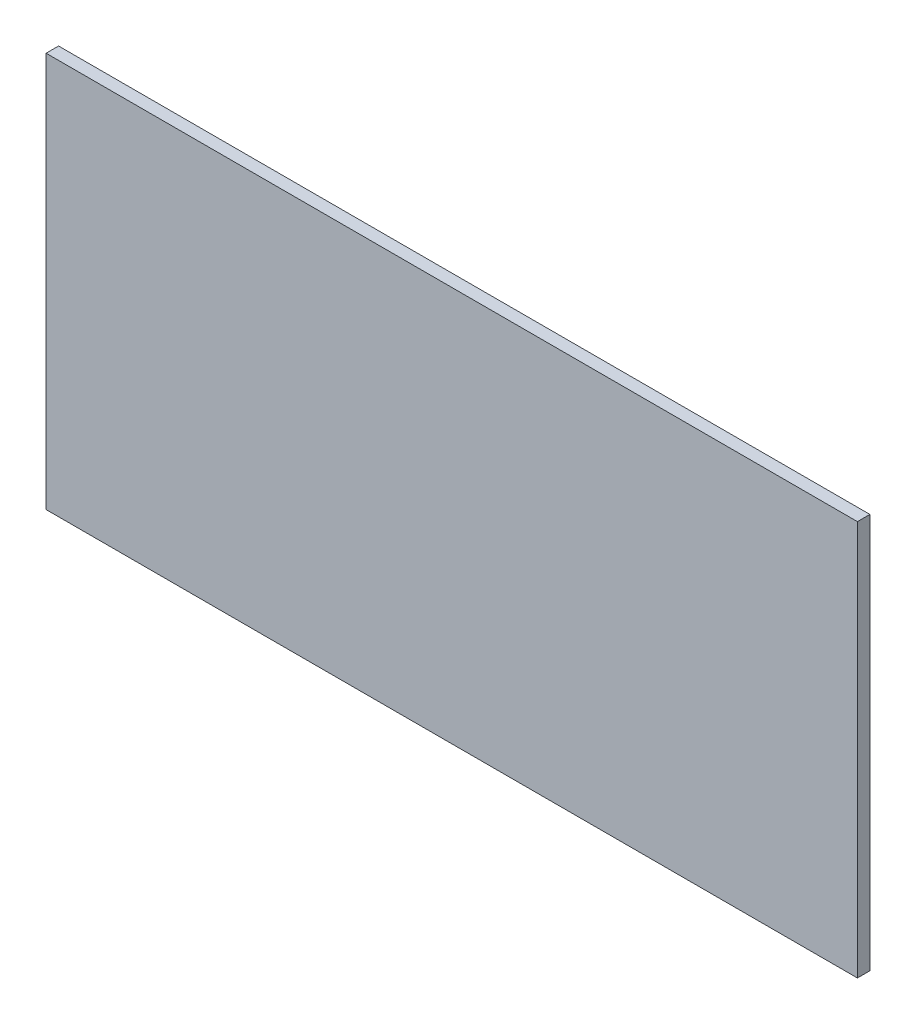
ISO-10303-21;
HEADER;
FILE_DESCRIPTION(('STEP AP214'),'2;1');
FILE_NAME('part.step','',(''),(''),'','','');
FILE_SCHEMA(('AUTOMOTIVE_DESIGN { 1 0 10303 214 1 1 1 1 }'));
ENDSEC;
DATA;
#1=APPLICATION_CONTEXT('core data for automotive mechanical design processes');
#2=APPLICATION_PROTOCOL_DEFINITION('international standard','automotive_design',2000,#1);
#3=PRODUCT_CONTEXT('',#1,'mechanical');
#4=PRODUCT('Part','Part','',(#3));
#5=PRODUCT_RELATED_PRODUCT_CATEGORY('part','',(#4));
#6=PRODUCT_DEFINITION_FORMATION('','',#4);
#7=PRODUCT_DEFINITION_CONTEXT('part definition',#1,'design');
#8=PRODUCT_DEFINITION('design','',#6,#7);
#9=PRODUCT_DEFINITION_SHAPE('','',#8);
#10=(LENGTH_UNIT() NAMED_UNIT(*) SI_UNIT(.MILLI.,.METRE.));
#11=(NAMED_UNIT(*) PLANE_ANGLE_UNIT() SI_UNIT($,.RADIAN.));
#12=(NAMED_UNIT(*) SI_UNIT($,.STERADIAN.) SOLID_ANGLE_UNIT());
#13=UNCERTAINTY_MEASURE_WITH_UNIT(LENGTH_MEASURE(1.E-05),#10,'distance_accuracy_value','');
#14=(GEOMETRIC_REPRESENTATION_CONTEXT(3) GLOBAL_UNCERTAINTY_ASSIGNED_CONTEXT((#13)) GLOBAL_UNIT_ASSIGNED_CONTEXT((#10,
#11,#12)) REPRESENTATION_CONTEXT('',''));
#15=CARTESIAN_POINT('',(0.,0.,0.));
#16=DIRECTION('',(0.,0.,1.));
#17=DIRECTION('',(1.,0.,0.));
#18=AXIS2_PLACEMENT_3D('',#15,#16,#17);
#19=CARTESIAN_POINT('',(0.,0.,3.));
#20=DIRECTION('',(1.,0.,0.));
#21=DIRECTION('',(0.,0.,-1.));
#22=AXIS2_PLACEMENT_3D('',#19,#20,#21);
#23=PLANE('',#22);
#24=DIRECTION('',(0.,-1.,0.));
#25=VECTOR('',#24,1.);
#26=CARTESIAN_POINT('',(0.,0.,0.));
#27=LINE('',#26,#25);
#28=CARTESIAN_POINT('',(0.,95.,0.));
#29=VERTEX_POINT('',#28);
#30=CARTESIAN_POINT('',(0.,0.,0.));
#31=VERTEX_POINT('',#30);
#32=EDGE_CURVE('E94',#29,#31,#27,.T.);
#33=ORIENTED_EDGE('',*,*,#32,.T.);
#34=DIRECTION('',(0.,0.,-1.));
#35=VECTOR('',#34,1.);
#36=CARTESIAN_POINT('',(0.,0.,3.));
#37=LINE('',#36,#35);
#38=CARTESIAN_POINT('',(0.,0.,3.));
#39=VERTEX_POINT('',#38);
#40=EDGE_CURVE('E11',#39,#31,#37,.T.);
#41=ORIENTED_EDGE('',*,*,#40,.F.);
#42=DIRECTION('',(0.,-1.,0.));
#43=VECTOR('',#42,1.);
#44=CARTESIAN_POINT('',(0.,0.,3.));
#45=LINE('',#44,#43);
#46=CARTESIAN_POINT('',(0.,95.,3.));
#47=VERTEX_POINT('',#46);
#48=EDGE_CURVE('E82',#47,#39,#45,.T.);
#49=ORIENTED_EDGE('',*,*,#48,.F.);
#50=DIRECTION('',(0.,0.,-1.));
#51=VECTOR('',#50,1.);
#52=CARTESIAN_POINT('',(0.,95.,3.));
#53=LINE('',#52,#51);
#54=EDGE_CURVE('E90',#47,#29,#53,.T.);
#55=ORIENTED_EDGE('',*,*,#54,.T.);
#56=EDGE_LOOP('',(#33,#41,#49,#55));
#57=FACE_BOUND('',#56,.T.);
#58=ADVANCED_FACE('F31',(#57),#23,.F.);
#59=CARTESIAN_POINT('',(0.,0.,3.));
#60=DIRECTION('',(0.,1.,0.));
#61=DIRECTION('',(0.,0.,1.));
#62=AXIS2_PLACEMENT_3D('',#59,#60,#61);
#63=PLANE('',#62);
#64=DIRECTION('',(1.,0.,0.));
#65=VECTOR('',#64,1.);
#66=CARTESIAN_POINT('',(0.,0.,0.));
#67=LINE('',#66,#65);
#68=CARTESIAN_POINT('',(195.,0.,0.));
#69=VERTEX_POINT('',#68);
#70=EDGE_CURVE('E86',#31,#69,#67,.T.);
#71=ORIENTED_EDGE('',*,*,#70,.T.);
#72=DIRECTION('',(0.,0.,-1.));
#73=VECTOR('',#72,1.);
#74=CARTESIAN_POINT('',(195.,0.,3.));
#75=LINE('',#74,#73);
#76=CARTESIAN_POINT('',(195.,0.,3.));
#77=VERTEX_POINT('',#76);
#78=EDGE_CURVE('E39',#77,#69,#75,.T.);
#79=ORIENTED_EDGE('',*,*,#78,.F.);
#80=DIRECTION('',(1.,0.,0.));
#81=VECTOR('',#80,1.);
#82=CARTESIAN_POINT('',(0.,0.,3.));
#83=LINE('',#82,#81);
#84=EDGE_CURVE('E77',#39,#77,#83,.T.);
#85=ORIENTED_EDGE('',*,*,#84,.F.);
#86=ORIENTED_EDGE('',*,*,#40,.T.);
#87=EDGE_LOOP('',(#71,#79,#85,#86));
#88=FACE_BOUND('',#87,.T.);
#89=ADVANCED_FACE('F85',(#88),#63,.F.);
#90=CARTESIAN_POINT('',(195.,0.,3.));
#91=DIRECTION('',(-1.,0.,0.));
#92=DIRECTION('',(0.,0.,1.));
#93=AXIS2_PLACEMENT_3D('',#90,#91,#92);
#94=PLANE('',#93);
#95=DIRECTION('',(0.,1.,0.));
#96=VECTOR('',#95,1.);
#97=CARTESIAN_POINT('',(195.,0.,0.));
#98=LINE('',#97,#96);
#99=CARTESIAN_POINT('',(195.,95.,0.));
#100=VERTEX_POINT('',#99);
#101=EDGE_CURVE('E64',#69,#100,#98,.T.);
#102=ORIENTED_EDGE('',*,*,#101,.T.);
#103=DIRECTION('',(0.,0.,-1.));
#104=VECTOR('',#103,1.);
#105=CARTESIAN_POINT('',(195.,95.,3.));
#106=LINE('',#105,#104);
#107=CARTESIAN_POINT('',(195.,95.,3.));
#108=VERTEX_POINT('',#107);
#109=EDGE_CURVE('E87',#108,#100,#106,.T.);
#110=ORIENTED_EDGE('',*,*,#109,.F.);
#111=DIRECTION('',(0.,1.,0.));
#112=VECTOR('',#111,1.);
#113=CARTESIAN_POINT('',(195.,0.,3.));
#114=LINE('',#113,#112);
#115=EDGE_CURVE('E80',#77,#108,#114,.T.);
#116=ORIENTED_EDGE('',*,*,#115,.F.);
#117=ORIENTED_EDGE('',*,*,#78,.T.);
#118=EDGE_LOOP('',(#102,#110,#116,#117));
#119=FACE_BOUND('',#118,.T.);
#120=ADVANCED_FACE('F88',(#119),#94,.F.);
#121=CARTESIAN_POINT('',(0.,95.,3.));
#122=DIRECTION('',(0.,-1.,0.));
#123=DIRECTION('',(0.,0.,-1.));
#124=AXIS2_PLACEMENT_3D('',#121,#122,#123);
#125=PLANE('',#124);
#126=DIRECTION('',(-1.,0.,0.));
#127=VECTOR('',#126,1.);
#128=CARTESIAN_POINT('',(0.,95.,0.));
#129=LINE('',#128,#127);
#130=EDGE_CURVE('E70',#100,#29,#129,.T.);
#131=ORIENTED_EDGE('',*,*,#130,.T.);
#132=ORIENTED_EDGE('',*,*,#54,.F.);
#133=DIRECTION('',(-1.,0.,0.));
#134=VECTOR('',#133,1.);
#135=CARTESIAN_POINT('',(0.,95.,3.));
#136=LINE('',#135,#134);
#137=EDGE_CURVE('E47',#108,#47,#136,.T.);
#138=ORIENTED_EDGE('',*,*,#137,.F.);
#139=ORIENTED_EDGE('',*,*,#109,.T.);
#140=EDGE_LOOP('',(#131,#132,#138,#139));
#141=FACE_BOUND('',#140,.T.);
#142=ADVANCED_FACE('F101',(#141),#125,.F.);
#143=CARTESIAN_POINT('',(0.,95.,3.));
#144=DIRECTION('',(0.,0.,-1.));
#145=DIRECTION('',(-1.,0.,0.));
#146=AXIS2_PLACEMENT_3D('',#143,#144,#145);
#147=PLANE('',#146);
#148=ORIENTED_EDGE('',*,*,#48,.T.);
#149=ORIENTED_EDGE('',*,*,#84,.T.);
#150=ORIENTED_EDGE('',*,*,#115,.T.);
#151=ORIENTED_EDGE('',*,*,#137,.T.);
#152=EDGE_LOOP('',(#148,#149,#150,#151));
#153=FACE_BOUND('',#152,.T.);
#154=ADVANCED_FACE('F78',(#153),#147,.F.);
#155=CARTESIAN_POINT('',(0.,95.,0.));
#156=DIRECTION('',(0.,0.,-1.));
#157=DIRECTION('',(-1.,0.,0.));
#158=AXIS2_PLACEMENT_3D('',#155,#156,#157);
#159=PLANE('',#158);
#160=ORIENTED_EDGE('',*,*,#32,.F.);
#161=ORIENTED_EDGE('',*,*,#130,.F.);
#162=ORIENTED_EDGE('',*,*,#101,.F.);
#163=ORIENTED_EDGE('',*,*,#70,.F.);
#164=EDGE_LOOP('',(#160,#161,#162,#163));
#165=FACE_BOUND('',#164,.T.);
#166=ADVANCED_FACE('F104',(#165),#159,.T.);
#167=CLOSED_SHELL('',(#58,#89,#120,#142,#154,#166));
#168=MANIFOLD_SOLID_BREP('B2',#167);
#169=ADVANCED_BREP_SHAPE_REPRESENTATION('',(#18,#168),#14);
#170=SHAPE_DEFINITION_REPRESENTATION(#9,#169);
ENDSEC;
END-ISO-10303-21;
